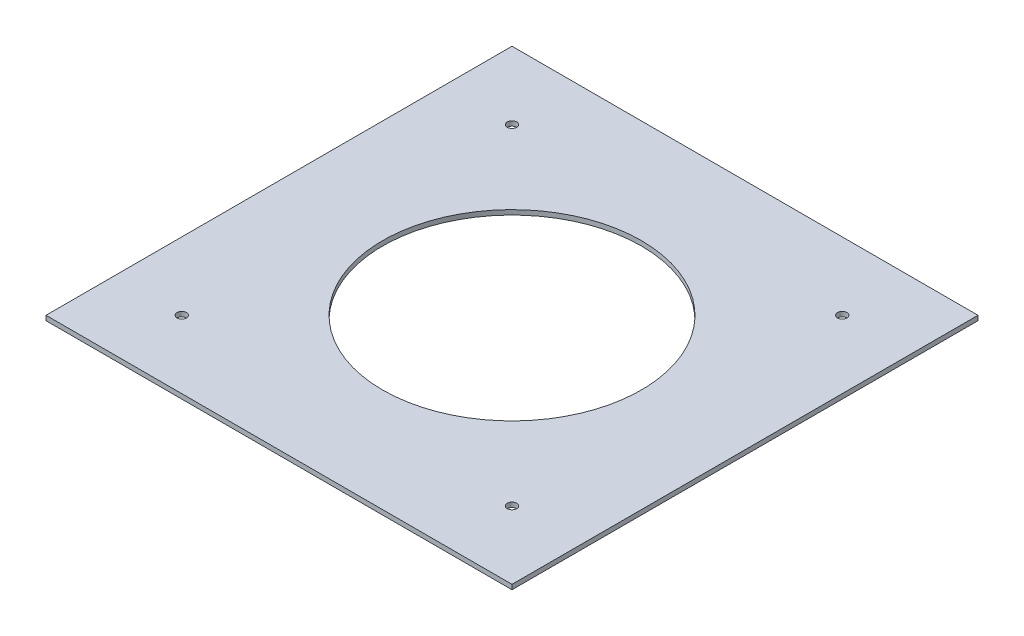
ISO-10303-21;
HEADER;
FILE_DESCRIPTION(('STEP AP214'),'2;1');
FILE_NAME('part.step','',(''),(''),'','','');
FILE_SCHEMA(('AUTOMOTIVE_DESIGN { 1 0 10303 214 1 1 1 1 }'));
ENDSEC;
DATA;
#1=APPLICATION_CONTEXT('core data for automotive mechanical design processes');
#2=APPLICATION_PROTOCOL_DEFINITION('international standard','automotive_design',2000,#1);
#3=PRODUCT_CONTEXT('',#1,'mechanical');
#4=PRODUCT('Part','Part','',(#3));
#5=PRODUCT_RELATED_PRODUCT_CATEGORY('part','',(#4));
#6=PRODUCT_DEFINITION_FORMATION('','',#4);
#7=PRODUCT_DEFINITION_CONTEXT('part definition',#1,'design');
#8=PRODUCT_DEFINITION('design','',#6,#7);
#9=PRODUCT_DEFINITION_SHAPE('','',#8);
#10=(LENGTH_UNIT() NAMED_UNIT(*) SI_UNIT(.MILLI.,.METRE.));
#11=(NAMED_UNIT(*) PLANE_ANGLE_UNIT() SI_UNIT($,.RADIAN.));
#12=(NAMED_UNIT(*) SI_UNIT($,.STERADIAN.) SOLID_ANGLE_UNIT());
#13=UNCERTAINTY_MEASURE_WITH_UNIT(LENGTH_MEASURE(1.E-05),#10,'distance_accuracy_value','');
#14=(GEOMETRIC_REPRESENTATION_CONTEXT(3) GLOBAL_UNCERTAINTY_ASSIGNED_CONTEXT((#13)) GLOBAL_UNIT_ASSIGNED_CONTEXT((#10,
#11,#12)) REPRESENTATION_CONTEXT('',''));
#15=CARTESIAN_POINT('',(0.,0.,0.));
#16=DIRECTION('',(0.,0.,1.));
#17=DIRECTION('',(1.,0.,0.));
#18=AXIS2_PLACEMENT_3D('',#15,#16,#17);
#19=CARTESIAN_POINT('',(49.3914086658803,1.000000032,49.3914086658803));
#20=DIRECTION('',(-1.,0.,0.));
#21=DIRECTION('',(0.,0.,1.));
#22=AXIS2_PLACEMENT_3D('',#19,#20,#21);
#23=PLANE('',#22);
#24=DIRECTION('',(0.,0.,-1.));
#25=VECTOR('',#24,1.);
#26=CARTESIAN_POINT('',(49.3914086658803,0.,49.3914086658803));
#27=LINE('',#26,#25);
#28=CARTESIAN_POINT('',(49.3914086658803,0.,49.3914086658803));
#29=VERTEX_POINT('',#28);
#30=CARTESIAN_POINT('',(49.3914086658803,0.,-49.3914086658804));
#31=VERTEX_POINT('',#30);
#32=EDGE_CURVE('E102',#29,#31,#27,.T.);
#33=ORIENTED_EDGE('',*,*,#32,.T.);
#34=DIRECTION('',(0.,-1.,0.));
#35=VECTOR('',#34,1.);
#36=CARTESIAN_POINT('',(49.3914086658803,1.000000032,-49.3914086658804));
#37=LINE('',#36,#35);
#38=CARTESIAN_POINT('',(49.3914086658803,1.000000032,-49.3914086658804));
#39=VERTEX_POINT('',#38);
#40=EDGE_CURVE('E11',#39,#31,#37,.T.);
#41=ORIENTED_EDGE('',*,*,#40,.F.);
#42=DIRECTION('',(0.,0.,-1.));
#43=VECTOR('',#42,1.);
#44=CARTESIAN_POINT('',(49.3914086658803,1.000000032,49.3914086658803));
#45=LINE('',#44,#43);
#46=CARTESIAN_POINT('',(49.3914086658803,1.000000032,49.3914086658803));
#47=VERTEX_POINT('',#46);
#48=EDGE_CURVE('E90',#47,#39,#45,.T.);
#49=ORIENTED_EDGE('',*,*,#48,.F.);
#50=DIRECTION('',(0.,-1.,0.));
#51=VECTOR('',#50,1.);
#52=CARTESIAN_POINT('',(49.3914086658803,1.000000032,49.3914086658803));
#53=LINE('',#52,#51);
#54=EDGE_CURVE('E98',#47,#29,#53,.T.);
#55=ORIENTED_EDGE('',*,*,#54,.T.);
#56=EDGE_LOOP('',(#33,#41,#49,#55));
#57=FACE_BOUND('',#56,.T.);
#58=ADVANCED_FACE('F39',(#57),#23,.F.);
#59=CARTESIAN_POINT('',(-49.3914086658803,1.000000032,-49.3914086658804));
#60=DIRECTION('',(0.,0.,1.));
#61=DIRECTION('',(1.,0.,0.));
#62=AXIS2_PLACEMENT_3D('',#59,#60,#61);
#63=PLANE('',#62);
#64=DIRECTION('',(-1.,0.,0.));
#65=VECTOR('',#64,1.);
#66=CARTESIAN_POINT('',(-49.3914086658803,0.,-49.3914086658804));
#67=LINE('',#66,#65);
#68=CARTESIAN_POINT('',(-49.3914086658803,0.,-49.3914086658804));
#69=VERTEX_POINT('',#68);
#70=EDGE_CURVE('E94',#31,#69,#67,.T.);
#71=ORIENTED_EDGE('',*,*,#70,.T.);
#72=DIRECTION('',(0.,-1.,0.));
#73=VECTOR('',#72,1.);
#74=CARTESIAN_POINT('',(-49.3914086658803,1.000000032,-49.3914086658804));
#75=LINE('',#74,#73);
#76=CARTESIAN_POINT('',(-49.3914086658803,1.000000032,-49.3914086658804));
#77=VERTEX_POINT('',#76);
#78=EDGE_CURVE('E47',#77,#69,#75,.T.);
#79=ORIENTED_EDGE('',*,*,#78,.F.);
#80=DIRECTION('',(-1.,0.,0.));
#81=VECTOR('',#80,1.);
#82=CARTESIAN_POINT('',(-49.3914086658803,1.000000032,-49.3914086658804));
#83=LINE('',#82,#81);
#84=EDGE_CURVE('E85',#39,#77,#83,.T.);
#85=ORIENTED_EDGE('',*,*,#84,.F.);
#86=ORIENTED_EDGE('',*,*,#40,.T.);
#87=EDGE_LOOP('',(#71,#79,#85,#86));
#88=FACE_BOUND('',#87,.T.);
#89=ADVANCED_FACE('F93',(#88),#63,.F.);
#90=CARTESIAN_POINT('',(-49.3914086658803,1.000000032,49.3914086658803));
#91=DIRECTION('',(1.,0.,0.));
#92=DIRECTION('',(0.,0.,-1.));
#93=AXIS2_PLACEMENT_3D('',#90,#91,#92);
#94=PLANE('',#93);
#95=DIRECTION('',(0.,0.,1.));
#96=VECTOR('',#95,1.);
#97=CARTESIAN_POINT('',(-49.3914086658803,0.,49.3914086658803));
#98=LINE('',#97,#96);
#99=CARTESIAN_POINT('',(-49.3914086658803,0.,49.3914086658803));
#100=VERTEX_POINT('',#99);
#101=EDGE_CURVE('E72',#69,#100,#98,.T.);
#102=ORIENTED_EDGE('',*,*,#101,.T.);
#103=DIRECTION('',(0.,-1.,0.));
#104=VECTOR('',#103,1.);
#105=CARTESIAN_POINT('',(-49.3914086658803,1.000000032,49.3914086658803));
#106=LINE('',#105,#104);
#107=CARTESIAN_POINT('',(-49.3914086658803,1.000000032,49.3914086658803));
#108=VERTEX_POINT('',#107);
#109=EDGE_CURVE('E95',#108,#100,#106,.T.);
#110=ORIENTED_EDGE('',*,*,#109,.F.);
#111=DIRECTION('',(0.,0.,1.));
#112=VECTOR('',#111,1.);
#113=CARTESIAN_POINT('',(-49.3914086658803,1.000000032,49.3914086658803));
#114=LINE('',#113,#112);
#115=EDGE_CURVE('E88',#77,#108,#114,.T.);
#116=ORIENTED_EDGE('',*,*,#115,.F.);
#117=ORIENTED_EDGE('',*,*,#78,.T.);
#118=EDGE_LOOP('',(#102,#110,#116,#117));
#119=FACE_BOUND('',#118,.T.);
#120=ADVANCED_FACE('F96',(#119),#94,.F.);
#121=CARTESIAN_POINT('',(-49.3914086658803,1.000000032,49.3914086658803));
#122=DIRECTION('',(0.,0.,-1.));
#123=DIRECTION('',(-1.,0.,0.));
#124=AXIS2_PLACEMENT_3D('',#121,#122,#123);
#125=PLANE('',#124);
#126=DIRECTION('',(1.,0.,0.));
#127=VECTOR('',#126,1.);
#128=CARTESIAN_POINT('',(-49.3914086658803,0.,49.3914086658803));
#129=LINE('',#128,#127);
#130=EDGE_CURVE('E78',#100,#29,#129,.T.);
#131=ORIENTED_EDGE('',*,*,#130,.T.);
#132=ORIENTED_EDGE('',*,*,#54,.F.);
#133=DIRECTION('',(1.,0.,0.));
#134=VECTOR('',#133,1.);
#135=CARTESIAN_POINT('',(-49.3914086658803,1.000000032,49.3914086658803));
#136=LINE('',#135,#134);
#137=EDGE_CURVE('E55',#108,#47,#136,.T.);
#138=ORIENTED_EDGE('',*,*,#137,.F.);
#139=ORIENTED_EDGE('',*,*,#109,.T.);
#140=EDGE_LOOP('',(#131,#132,#138,#139));
#141=FACE_BOUND('',#140,.T.);
#142=ADVANCED_FACE('F110',(#141),#125,.F.);
#143=CARTESIAN_POINT('',(0.,1.000000032,0.));
#144=DIRECTION('',(0.,-1.,0.));
#145=DIRECTION('',(0.,0.,-1.));
#146=AXIS2_PLACEMENT_3D('',#143,#144,#145);
#147=PLANE('',#146);
#148=CARTESIAN_POINT('',(0.,1.000000032,0.));
#149=DIRECTION('',(0.,1.,0.));
#150=DIRECTION('',(0.,0.,1.));
#151=AXIS2_PLACEMENT_3D('',#148,#149,#150);
#152=CIRCLE('',#151,27.432);
#153=CARTESIAN_POINT('',(0.,1.000000032,27.432));
#154=VERTEX_POINT('',#153);
#155=EDGE_CURVE('E126',#154,#154,#152,.T.);
#156=ORIENTED_EDGE('',*,*,#155,.F.);
#157=EDGE_LOOP('',(#156));
#158=FACE_BOUND('',#157,.T.);
#159=CARTESIAN_POINT('',(-35.0017875072118,1.000000032,-35.0017875072117));
#160=DIRECTION('',(0.,1.,0.));
#161=DIRECTION('',(0.,0.,1.));
#162=AXIS2_PLACEMENT_3D('',#159,#160,#161);
#163=CIRCLE('',#162,0.999998000000003);
#164=CARTESIAN_POINT('',(-35.0017875072118,1.000000032,-34.0017895072117));
#165=VERTEX_POINT('',#164);
#166=EDGE_CURVE('E122',#165,#165,#163,.T.);
#167=ORIENTED_EDGE('',*,*,#166,.F.);
#168=EDGE_LOOP('',(#167));
#169=FACE_BOUND('',#168,.T.);
#170=CARTESIAN_POINT('',(-35.0017875072117,1.000000032,35.0017875072118));
#171=DIRECTION('',(0.,1.,0.));
#172=DIRECTION('',(0.,0.,1.));
#173=AXIS2_PLACEMENT_3D('',#170,#171,#172);
#174=CIRCLE('',#173,0.999998000000003);
#175=CARTESIAN_POINT('',(-35.0017875072117,1.000000032,36.0017855072117));
#176=VERTEX_POINT('',#175);
#177=EDGE_CURVE('E129',#176,#176,#174,.T.);
#178=ORIENTED_EDGE('',*,*,#177,.F.);
#179=EDGE_LOOP('',(#178));
#180=FACE_BOUND('',#179,.T.);
#181=CARTESIAN_POINT('',(35.0017875072118,1.000000032,35.0017875072117));
#182=DIRECTION('',(0.,1.,0.));
#183=DIRECTION('',(0.,0.,1.));
#184=AXIS2_PLACEMENT_3D('',#181,#182,#183);
#185=CIRCLE('',#184,0.999998000000003);
#186=CARTESIAN_POINT('',(35.0017875072118,1.000000032,36.0017855072117));
#187=VERTEX_POINT('',#186);
#188=EDGE_CURVE('E135',#187,#187,#185,.T.);
#189=ORIENTED_EDGE('',*,*,#188,.F.);
#190=EDGE_LOOP('',(#189));
#191=FACE_BOUND('',#190,.T.);
#192=CARTESIAN_POINT('',(35.0017875072117,1.000000032,-35.0017875072118));
#193=DIRECTION('',(0.,1.,0.));
#194=DIRECTION('',(0.,0.,1.));
#195=AXIS2_PLACEMENT_3D('',#192,#193,#194);
#196=CIRCLE('',#195,0.999998000000003);
#197=CARTESIAN_POINT('',(35.0017875072117,1.000000032,-34.0017895072117));
#198=VERTEX_POINT('',#197);
#199=EDGE_CURVE('E105',#198,#198,#196,.T.);
#200=ORIENTED_EDGE('',*,*,#199,.F.);
#201=EDGE_LOOP('',(#200));
#202=FACE_BOUND('',#201,.T.);
#203=ORIENTED_EDGE('',*,*,#48,.T.);
#204=ORIENTED_EDGE('',*,*,#84,.T.);
#205=ORIENTED_EDGE('',*,*,#115,.T.);
#206=ORIENTED_EDGE('',*,*,#137,.T.);
#207=EDGE_LOOP('',(#203,#204,#205,#206));
#208=FACE_BOUND('',#207,.T.);
#209=ADVANCED_FACE('F86',(#158,#169,#180,#191,#202,#208),#147,.F.);
#210=CARTESIAN_POINT('',(0.,0.,0.));
#211=DIRECTION('',(0.,-1.,0.));
#212=DIRECTION('',(0.,0.,-1.));
#213=AXIS2_PLACEMENT_3D('',#210,#211,#212);
#214=PLANE('',#213);
#215=CARTESIAN_POINT('',(0.,0.,0.));
#216=DIRECTION('',(0.,1.,0.));
#217=DIRECTION('',(0.,0.,1.));
#218=AXIS2_PLACEMENT_3D('',#215,#216,#217);
#219=CIRCLE('',#218,27.432);
#220=CARTESIAN_POINT('',(0.,0.,27.432));
#221=VERTEX_POINT('',#220);
#222=EDGE_CURVE('E140',#221,#221,#219,.T.);
#223=ORIENTED_EDGE('',*,*,#222,.T.);
#224=EDGE_LOOP('',(#223));
#225=FACE_BOUND('',#224,.T.);
#226=CARTESIAN_POINT('',(-35.0017875072118,0.,-35.0017875072117));
#227=DIRECTION('',(0.,1.,0.));
#228=DIRECTION('',(0.,0.,1.));
#229=AXIS2_PLACEMENT_3D('',#226,#227,#228);
#230=CIRCLE('',#229,0.999998000000003);
#231=CARTESIAN_POINT('',(-35.0017875072118,0.,-34.0017895072117));
#232=VERTEX_POINT('',#231);
#233=EDGE_CURVE('E125',#232,#232,#230,.T.);
#234=ORIENTED_EDGE('',*,*,#233,.T.);
#235=EDGE_LOOP('',(#234));
#236=FACE_BOUND('',#235,.T.);
#237=CARTESIAN_POINT('',(-35.0017875072117,0.,35.0017875072118));
#238=DIRECTION('',(0.,1.,0.));
#239=DIRECTION('',(0.,0.,1.));
#240=AXIS2_PLACEMENT_3D('',#237,#238,#239);
#241=CIRCLE('',#240,0.999998000000003);
#242=CARTESIAN_POINT('',(-35.0017875072117,0.,36.0017855072117));
#243=VERTEX_POINT('',#242);
#244=EDGE_CURVE('E132',#243,#243,#241,.T.);
#245=ORIENTED_EDGE('',*,*,#244,.T.);
#246=EDGE_LOOP('',(#245));
#247=FACE_BOUND('',#246,.T.);
#248=CARTESIAN_POINT('',(35.0017875072118,0.,35.0017875072117));
#249=DIRECTION('',(0.,1.,0.));
#250=DIRECTION('',(0.,0.,1.));
#251=AXIS2_PLACEMENT_3D('',#248,#249,#250);
#252=CIRCLE('',#251,0.999998000000003);
#253=CARTESIAN_POINT('',(35.0017875072118,0.,36.0017855072117));
#254=VERTEX_POINT('',#253);
#255=EDGE_CURVE('E119',#254,#254,#252,.T.);
#256=ORIENTED_EDGE('',*,*,#255,.T.);
#257=EDGE_LOOP('',(#256));
#258=FACE_BOUND('',#257,.T.);
#259=CARTESIAN_POINT('',(35.0017875072117,0.,-35.0017875072118));
#260=DIRECTION('',(0.,1.,0.));
#261=DIRECTION('',(0.,0.,1.));
#262=AXIS2_PLACEMENT_3D('',#259,#260,#261);
#263=CIRCLE('',#262,0.999998000000003);
#264=CARTESIAN_POINT('',(35.0017875072117,0.,-34.0017895072117));
#265=VERTEX_POINT('',#264);
#266=EDGE_CURVE('E116',#265,#265,#263,.T.);
#267=ORIENTED_EDGE('',*,*,#266,.T.);
#268=EDGE_LOOP('',(#267));
#269=FACE_BOUND('',#268,.T.);
#270=ORIENTED_EDGE('',*,*,#32,.F.);
#271=ORIENTED_EDGE('',*,*,#130,.F.);
#272=ORIENTED_EDGE('',*,*,#101,.F.);
#273=ORIENTED_EDGE('',*,*,#70,.F.);
#274=EDGE_LOOP('',(#270,#271,#272,#273));
#275=FACE_BOUND('',#274,.T.);
#276=ADVANCED_FACE('F113',(#225,#236,#247,#258,#269,#275),#214,.T.);
#277=CARTESIAN_POINT('',(35.0017875072117,1.000000032,-35.0017875072118));
#278=DIRECTION('',(0.,-1.,0.));
#279=DIRECTION('',(0.,0.,-1.));
#280=AXIS2_PLACEMENT_3D('',#277,#278,#279);
#281=CYLINDRICAL_SURFACE('',#280,0.999998000000003);
#282=ORIENTED_EDGE('',*,*,#199,.T.);
#283=EDGE_LOOP('',(#282));
#284=FACE_BOUND('',#283,.T.);
#285=ORIENTED_EDGE('',*,*,#266,.F.);
#286=EDGE_LOOP('',(#285));
#287=FACE_BOUND('',#286,.T.);
#288=ADVANCED_FACE('F160',(#284,#287),#281,.F.);
#289=CARTESIAN_POINT('',(35.0017875072118,1.000000032,35.0017875072117));
#290=DIRECTION('',(0.,-1.,0.));
#291=DIRECTION('',(0.,0.,-1.));
#292=AXIS2_PLACEMENT_3D('',#289,#290,#291);
#293=CYLINDRICAL_SURFACE('',#292,0.999998000000003);
#294=ORIENTED_EDGE('',*,*,#188,.T.);
#295=EDGE_LOOP('',(#294));
#296=FACE_BOUND('',#295,.T.);
#297=ORIENTED_EDGE('',*,*,#255,.F.);
#298=EDGE_LOOP('',(#297));
#299=FACE_BOUND('',#298,.T.);
#300=ADVANCED_FACE('F163',(#296,#299),#293,.F.);
#301=CARTESIAN_POINT('',(-35.0017875072117,1.000000032,35.0017875072118));
#302=DIRECTION('',(0.,-1.,0.));
#303=DIRECTION('',(0.,0.,-1.));
#304=AXIS2_PLACEMENT_3D('',#301,#302,#303);
#305=CYLINDRICAL_SURFACE('',#304,0.999998000000003);
#306=ORIENTED_EDGE('',*,*,#177,.T.);
#307=EDGE_LOOP('',(#306));
#308=FACE_BOUND('',#307,.T.);
#309=ORIENTED_EDGE('',*,*,#244,.F.);
#310=EDGE_LOOP('',(#309));
#311=FACE_BOUND('',#310,.T.);
#312=ADVANCED_FACE('F201',(#308,#311),#305,.F.);
#313=CARTESIAN_POINT('',(-35.0017875072118,1.000000032,-35.0017875072117));
#314=DIRECTION('',(0.,-1.,0.));
#315=DIRECTION('',(0.,0.,-1.));
#316=AXIS2_PLACEMENT_3D('',#313,#314,#315);
#317=CYLINDRICAL_SURFACE('',#316,0.999998000000003);
#318=ORIENTED_EDGE('',*,*,#166,.T.);
#319=EDGE_LOOP('',(#318));
#320=FACE_BOUND('',#319,.T.);
#321=ORIENTED_EDGE('',*,*,#233,.F.);
#322=EDGE_LOOP('',(#321));
#323=FACE_BOUND('',#322,.T.);
#324=ADVANCED_FACE('F210',(#320,#323),#317,.F.);
#325=CARTESIAN_POINT('',(0.,1.000000032,0.));
#326=DIRECTION('',(0.,-1.,0.));
#327=DIRECTION('',(0.,0.,-1.));
#328=AXIS2_PLACEMENT_3D('',#325,#326,#327);
#329=CYLINDRICAL_SURFACE('',#328,27.432);
#330=ORIENTED_EDGE('',*,*,#155,.T.);
#331=EDGE_LOOP('',(#330));
#332=FACE_BOUND('',#331,.T.);
#333=ORIENTED_EDGE('',*,*,#222,.F.);
#334=EDGE_LOOP('',(#333));
#335=FACE_BOUND('',#334,.T.);
#336=ADVANCED_FACE('F146',(#332,#335),#329,.F.);
#337=CLOSED_SHELL('',(#58,#89,#120,#142,#209,#276,#288,#300,#312,#324,#336));
#338=MANIFOLD_SOLID_BREP('B2',#337);
#339=ADVANCED_BREP_SHAPE_REPRESENTATION('',(#18,#338),#14);
#340=SHAPE_DEFINITION_REPRESENTATION(#9,#339);
ENDSEC;
END-ISO-10303-21;
